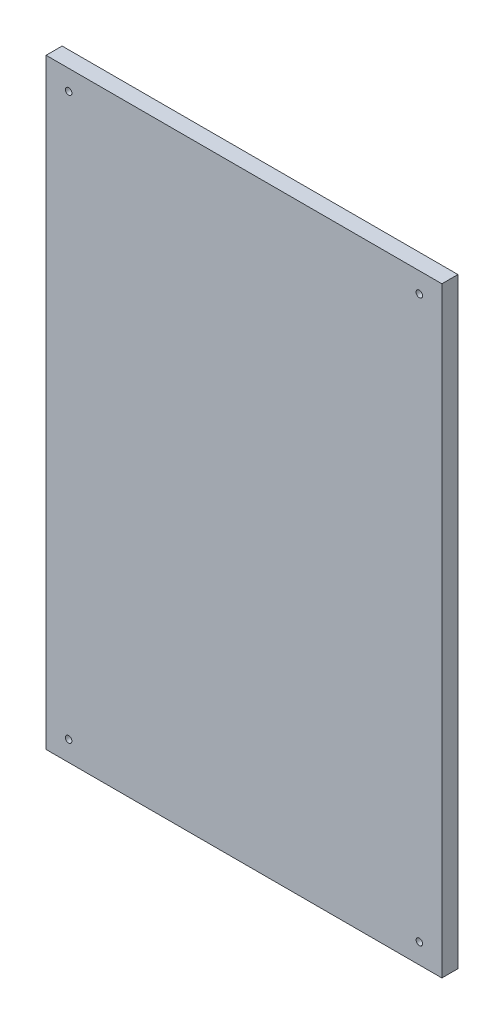
ISO-10303-21;
HEADER;
FILE_DESCRIPTION(('STEP AP214'),'2;1');
FILE_NAME('part.step','',(''),(''),'','','');
FILE_SCHEMA(('AUTOMOTIVE_DESIGN { 1 0 10303 214 1 1 1 1 }'));
ENDSEC;
DATA;
#1=APPLICATION_CONTEXT('core data for automotive mechanical design processes');
#2=APPLICATION_PROTOCOL_DEFINITION('international standard','automotive_design',2000,#1);
#3=PRODUCT_CONTEXT('',#1,'mechanical');
#4=PRODUCT('Part','Part','',(#3));
#5=PRODUCT_RELATED_PRODUCT_CATEGORY('part','',(#4));
#6=PRODUCT_DEFINITION_FORMATION('','',#4);
#7=PRODUCT_DEFINITION_CONTEXT('part definition',#1,'design');
#8=PRODUCT_DEFINITION('design','',#6,#7);
#9=PRODUCT_DEFINITION_SHAPE('','',#8);
#10=(LENGTH_UNIT() NAMED_UNIT(*) SI_UNIT(.MILLI.,.METRE.));
#11=(NAMED_UNIT(*) PLANE_ANGLE_UNIT() SI_UNIT($,.RADIAN.));
#12=(NAMED_UNIT(*) SI_UNIT($,.STERADIAN.) SOLID_ANGLE_UNIT());
#13=UNCERTAINTY_MEASURE_WITH_UNIT(LENGTH_MEASURE(1.E-05),#10,'distance_accuracy_value','');
#14=(GEOMETRIC_REPRESENTATION_CONTEXT(3) GLOBAL_UNCERTAINTY_ASSIGNED_CONTEXT((#13)) GLOBAL_UNIT_ASSIGNED_CONTEXT((#10,
#11,#12)) REPRESENTATION_CONTEXT('',''));
#15=CARTESIAN_POINT('',(0.,0.,0.));
#16=DIRECTION('',(0.,0.,1.));
#17=DIRECTION('',(1.,0.,0.));
#18=AXIS2_PLACEMENT_3D('',#15,#16,#17);
#19=CARTESIAN_POINT('',(0.,0.,16.));
#20=DIRECTION('',(1.,0.,0.));
#21=DIRECTION('',(0.,0.,-1.));
#22=AXIS2_PLACEMENT_3D('',#19,#20,#21);
#23=PLANE('',#22);
#24=DIRECTION('',(0.,-1.,0.));
#25=VECTOR('',#24,1.);
#26=CARTESIAN_POINT('',(0.,0.,0.));
#27=LINE('',#26,#25);
#28=CARTESIAN_POINT('',(0.,600.,0.));
#29=VERTEX_POINT('',#28);
#30=CARTESIAN_POINT('',(0.,0.,0.));
#31=VERTEX_POINT('',#30);
#32=EDGE_CURVE('E96',#29,#31,#27,.T.);
#33=ORIENTED_EDGE('',*,*,#32,.T.);
#34=DIRECTION('',(0.,0.,-1.));
#35=VECTOR('',#34,1.);
#36=CARTESIAN_POINT('',(0.,0.,16.));
#37=LINE('',#36,#35);
#38=CARTESIAN_POINT('',(0.,0.,16.));
#39=VERTEX_POINT('',#38);
#40=EDGE_CURVE('E11',#39,#31,#37,.T.);
#41=ORIENTED_EDGE('',*,*,#40,.F.);
#42=DIRECTION('',(0.,-1.,0.));
#43=VECTOR('',#42,1.);
#44=CARTESIAN_POINT('',(0.,0.,16.));
#45=LINE('',#44,#43);
#46=CARTESIAN_POINT('',(0.,600.,16.));
#47=VERTEX_POINT('',#46);
#48=EDGE_CURVE('E84',#47,#39,#45,.T.);
#49=ORIENTED_EDGE('',*,*,#48,.F.);
#50=DIRECTION('',(0.,0.,-1.));
#51=VECTOR('',#50,1.);
#52=CARTESIAN_POINT('',(0.,600.,16.));
#53=LINE('',#52,#51);
#54=EDGE_CURVE('E92',#47,#29,#53,.T.);
#55=ORIENTED_EDGE('',*,*,#54,.T.);
#56=EDGE_LOOP('',(#33,#41,#49,#55));
#57=FACE_BOUND('',#56,.T.);
#58=ADVANCED_FACE('F33',(#57),#23,.F.);
#59=CARTESIAN_POINT('',(0.,0.,16.));
#60=DIRECTION('',(0.,1.,0.));
#61=DIRECTION('',(0.,0.,1.));
#62=AXIS2_PLACEMENT_3D('',#59,#60,#61);
#63=PLANE('',#62);
#64=DIRECTION('',(1.,0.,0.));
#65=VECTOR('',#64,1.);
#66=CARTESIAN_POINT('',(0.,0.,0.));
#67=LINE('',#66,#65);
#68=CARTESIAN_POINT('',(395.,0.,0.));
#69=VERTEX_POINT('',#68);
#70=EDGE_CURVE('E88',#31,#69,#67,.T.);
#71=ORIENTED_EDGE('',*,*,#70,.T.);
#72=DIRECTION('',(0.,0.,-1.));
#73=VECTOR('',#72,1.);
#74=CARTESIAN_POINT('',(395.,0.,16.));
#75=LINE('',#74,#73);
#76=CARTESIAN_POINT('',(395.,0.,16.));
#77=VERTEX_POINT('',#76);
#78=EDGE_CURVE('E41',#77,#69,#75,.T.);
#79=ORIENTED_EDGE('',*,*,#78,.F.);
#80=DIRECTION('',(1.,0.,0.));
#81=VECTOR('',#80,1.);
#82=CARTESIAN_POINT('',(0.,0.,16.));
#83=LINE('',#82,#81);
#84=EDGE_CURVE('E79',#39,#77,#83,.T.);
#85=ORIENTED_EDGE('',*,*,#84,.F.);
#86=ORIENTED_EDGE('',*,*,#40,.T.);
#87=EDGE_LOOP('',(#71,#79,#85,#86));
#88=FACE_BOUND('',#87,.T.);
#89=ADVANCED_FACE('F87',(#88),#63,.F.);
#90=CARTESIAN_POINT('',(395.,0.,16.));
#91=DIRECTION('',(-1.,0.,0.));
#92=DIRECTION('',(0.,0.,1.));
#93=AXIS2_PLACEMENT_3D('',#90,#91,#92);
#94=PLANE('',#93);
#95=DIRECTION('',(0.,1.,0.));
#96=VECTOR('',#95,1.);
#97=CARTESIAN_POINT('',(395.,0.,0.));
#98=LINE('',#97,#96);
#99=CARTESIAN_POINT('',(395.,600.,0.));
#100=VERTEX_POINT('',#99);
#101=EDGE_CURVE('E66',#69,#100,#98,.T.);
#102=ORIENTED_EDGE('',*,*,#101,.T.);
#103=DIRECTION('',(0.,0.,-1.));
#104=VECTOR('',#103,1.);
#105=CARTESIAN_POINT('',(395.,600.,16.));
#106=LINE('',#105,#104);
#107=CARTESIAN_POINT('',(395.,600.,16.));
#108=VERTEX_POINT('',#107);
#109=EDGE_CURVE('E89',#108,#100,#106,.T.);
#110=ORIENTED_EDGE('',*,*,#109,.F.);
#111=DIRECTION('',(0.,1.,0.));
#112=VECTOR('',#111,1.);
#113=CARTESIAN_POINT('',(395.,0.,16.));
#114=LINE('',#113,#112);
#115=EDGE_CURVE('E82',#77,#108,#114,.T.);
#116=ORIENTED_EDGE('',*,*,#115,.F.);
#117=ORIENTED_EDGE('',*,*,#78,.T.);
#118=EDGE_LOOP('',(#102,#110,#116,#117));
#119=FACE_BOUND('',#118,.T.);
#120=ADVANCED_FACE('F90',(#119),#94,.F.);
#121=CARTESIAN_POINT('',(0.,600.,16.));
#122=DIRECTION('',(0.,-1.,0.));
#123=DIRECTION('',(0.,0.,-1.));
#124=AXIS2_PLACEMENT_3D('',#121,#122,#123);
#125=PLANE('',#124);
#126=DIRECTION('',(-1.,0.,0.));
#127=VECTOR('',#126,1.);
#128=CARTESIAN_POINT('',(0.,600.,0.));
#129=LINE('',#128,#127);
#130=EDGE_CURVE('E72',#100,#29,#129,.T.);
#131=ORIENTED_EDGE('',*,*,#130,.T.);
#132=ORIENTED_EDGE('',*,*,#54,.F.);
#133=DIRECTION('',(-1.,0.,0.));
#134=VECTOR('',#133,1.);
#135=CARTESIAN_POINT('',(0.,600.,16.));
#136=LINE('',#135,#134);
#137=EDGE_CURVE('E49',#108,#47,#136,.T.);
#138=ORIENTED_EDGE('',*,*,#137,.F.);
#139=ORIENTED_EDGE('',*,*,#109,.T.);
#140=EDGE_LOOP('',(#131,#132,#138,#139));
#141=FACE_BOUND('',#140,.T.);
#142=ADVANCED_FACE('F104',(#141),#125,.F.);
#143=CARTESIAN_POINT('',(0.,0.,16.));
#144=DIRECTION('',(0.,0.,-1.));
#145=DIRECTION('',(-1.,0.,0.));
#146=AXIS2_PLACEMENT_3D('',#143,#144,#145);
#147=PLANE('',#146);
#148=CARTESIAN_POINT('',(372.5,580.,16.));
#149=DIRECTION('',(0.,0.,1.));
#150=DIRECTION('',(1.,0.,0.));
#151=AXIS2_PLACEMENT_3D('',#148,#149,#150);
#152=CIRCLE('',#151,3.24999999999989);
#153=CARTESIAN_POINT('',(375.75,580.,16.));
#154=VERTEX_POINT('',#153);
#155=EDGE_CURVE('E128',#154,#154,#152,.T.);
#156=ORIENTED_EDGE('',*,*,#155,.F.);
#157=EDGE_LOOP('',(#156));
#158=FACE_BOUND('',#157,.T.);
#159=CARTESIAN_POINT('',(22.5000000000002,20.,16.));
#160=DIRECTION('',(0.,0.,1.));
#161=DIRECTION('',(-1.,0.,0.));
#162=AXIS2_PLACEMENT_3D('',#159,#160,#161);
#163=CIRCLE('',#162,3.24999999999995);
#164=CARTESIAN_POINT('',(19.2500000000003,20.,16.));
#165=VERTEX_POINT('',#164);
#166=EDGE_CURVE('E122',#165,#165,#163,.T.);
#167=ORIENTED_EDGE('',*,*,#166,.F.);
#168=EDGE_LOOP('',(#167));
#169=FACE_BOUND('',#168,.T.);
#170=CARTESIAN_POINT('',(372.5,20.,16.));
#171=DIRECTION('',(0.,0.,1.));
#172=DIRECTION('',(-1.,0.,0.));
#173=AXIS2_PLACEMENT_3D('',#170,#171,#172);
#174=CIRCLE('',#173,3.24999999999989);
#175=CARTESIAN_POINT('',(369.25,20.,16.));
#176=VERTEX_POINT('',#175);
#177=EDGE_CURVE('E116',#176,#176,#174,.T.);
#178=ORIENTED_EDGE('',*,*,#177,.F.);
#179=EDGE_LOOP('',(#178));
#180=FACE_BOUND('',#179,.T.);
#181=CARTESIAN_POINT('',(22.5000000000002,580.,16.));
#182=DIRECTION('',(0.,0.,1.));
#183=DIRECTION('',(1.,0.,0.));
#184=AXIS2_PLACEMENT_3D('',#181,#182,#183);
#185=CIRCLE('',#184,3.24999999999995);
#186=CARTESIAN_POINT('',(25.7500000000002,580.,16.));
#187=VERTEX_POINT('',#186);
#188=EDGE_CURVE('E110',#187,#187,#185,.T.);
#189=ORIENTED_EDGE('',*,*,#188,.F.);
#190=EDGE_LOOP('',(#189));
#191=FACE_BOUND('',#190,.T.);
#192=ORIENTED_EDGE('',*,*,#48,.T.);
#193=ORIENTED_EDGE('',*,*,#84,.T.);
#194=ORIENTED_EDGE('',*,*,#115,.T.);
#195=ORIENTED_EDGE('',*,*,#137,.T.);
#196=EDGE_LOOP('',(#192,#193,#194,#195));
#197=FACE_BOUND('',#196,.T.);
#198=ADVANCED_FACE('F80',(#158,#169,#180,#191,#197),#147,.F.);
#199=CARTESIAN_POINT('',(0.,0.,0.));
#200=DIRECTION('',(0.,0.,-1.));
#201=DIRECTION('',(-1.,0.,0.));
#202=AXIS2_PLACEMENT_3D('',#199,#200,#201);
#203=PLANE('',#202);
#204=CARTESIAN_POINT('',(372.5,580.,0.));
#205=DIRECTION('',(0.,0.,1.));
#206=DIRECTION('',(1.,0.,0.));
#207=AXIS2_PLACEMENT_3D('',#204,#205,#206);
#208=CIRCLE('',#207,3.24999999999989);
#209=CARTESIAN_POINT('',(375.75,580.,0.));
#210=VERTEX_POINT('',#209);
#211=EDGE_CURVE('E113',#210,#210,#208,.T.);
#212=ORIENTED_EDGE('',*,*,#211,.T.);
#213=EDGE_LOOP('',(#212));
#214=FACE_BOUND('',#213,.T.);
#215=CARTESIAN_POINT('',(22.5000000000002,20.,0.));
#216=DIRECTION('',(0.,0.,1.));
#217=DIRECTION('',(-1.,0.,0.));
#218=AXIS2_PLACEMENT_3D('',#215,#216,#217);
#219=CIRCLE('',#218,3.24999999999995);
#220=CARTESIAN_POINT('',(19.2500000000003,20.,0.));
#221=VERTEX_POINT('',#220);
#222=EDGE_CURVE('E125',#221,#221,#219,.T.);
#223=ORIENTED_EDGE('',*,*,#222,.T.);
#224=EDGE_LOOP('',(#223));
#225=FACE_BOUND('',#224,.T.);
#226=CARTESIAN_POINT('',(372.5,20.,0.));
#227=DIRECTION('',(0.,0.,1.));
#228=DIRECTION('',(-1.,0.,0.));
#229=AXIS2_PLACEMENT_3D('',#226,#227,#228);
#230=CIRCLE('',#229,3.24999999999989);
#231=CARTESIAN_POINT('',(369.25,20.,0.));
#232=VERTEX_POINT('',#231);
#233=EDGE_CURVE('E119',#232,#232,#230,.T.);
#234=ORIENTED_EDGE('',*,*,#233,.T.);
#235=EDGE_LOOP('',(#234));
#236=FACE_BOUND('',#235,.T.);
#237=CARTESIAN_POINT('',(22.5000000000002,580.,0.));
#238=DIRECTION('',(0.,0.,1.));
#239=DIRECTION('',(1.,0.,0.));
#240=AXIS2_PLACEMENT_3D('',#237,#238,#239);
#241=CIRCLE('',#240,3.24999999999995);
#242=CARTESIAN_POINT('',(25.7500000000002,580.,0.));
#243=VERTEX_POINT('',#242);
#244=EDGE_CURVE('E99',#243,#243,#241,.T.);
#245=ORIENTED_EDGE('',*,*,#244,.T.);
#246=EDGE_LOOP('',(#245));
#247=FACE_BOUND('',#246,.T.);
#248=ORIENTED_EDGE('',*,*,#32,.F.);
#249=ORIENTED_EDGE('',*,*,#130,.F.);
#250=ORIENTED_EDGE('',*,*,#101,.F.);
#251=ORIENTED_EDGE('',*,*,#70,.F.);
#252=EDGE_LOOP('',(#248,#249,#250,#251));
#253=FACE_BOUND('',#252,.T.);
#254=ADVANCED_FACE('F107',(#214,#225,#236,#247,#253),#203,.T.);
#255=CARTESIAN_POINT('',(22.5000000000002,580.,0.));
#256=DIRECTION('',(0.,0.,1.));
#257=DIRECTION('',(1.,0.,0.));
#258=AXIS2_PLACEMENT_3D('',#255,#256,#257);
#259=CYLINDRICAL_SURFACE('',#258,3.24999999999995);
#260=ORIENTED_EDGE('',*,*,#244,.F.);
#261=EDGE_LOOP('',(#260));
#262=FACE_BOUND('',#261,.T.);
#263=ORIENTED_EDGE('',*,*,#188,.T.);
#264=EDGE_LOOP('',(#263));
#265=FACE_BOUND('',#264,.T.);
#266=ADVANCED_FACE('F152',(#262,#265),#259,.F.);
#267=CARTESIAN_POINT('',(372.5,20.,0.));
#268=DIRECTION('',(0.,0.,1.));
#269=DIRECTION('',(1.,0.,0.));
#270=AXIS2_PLACEMENT_3D('',#267,#268,#269);
#271=CYLINDRICAL_SURFACE('',#270,3.24999999999989);
#272=ORIENTED_EDGE('',*,*,#233,.F.);
#273=EDGE_LOOP('',(#272));
#274=FACE_BOUND('',#273,.T.);
#275=ORIENTED_EDGE('',*,*,#177,.T.);
#276=EDGE_LOOP('',(#275));
#277=FACE_BOUND('',#276,.T.);
#278=ADVANCED_FACE('F154',(#274,#277),#271,.F.);
#279=CARTESIAN_POINT('',(22.5000000000002,20.,0.));
#280=DIRECTION('',(0.,0.,1.));
#281=DIRECTION('',(1.,0.,0.));
#282=AXIS2_PLACEMENT_3D('',#279,#280,#281);
#283=CYLINDRICAL_SURFACE('',#282,3.24999999999995);
#284=ORIENTED_EDGE('',*,*,#222,.F.);
#285=EDGE_LOOP('',(#284));
#286=FACE_BOUND('',#285,.T.);
#287=ORIENTED_EDGE('',*,*,#166,.T.);
#288=EDGE_LOOP('',(#287));
#289=FACE_BOUND('',#288,.T.);
#290=ADVANCED_FACE('F139',(#286,#289),#283,.F.);
#291=CARTESIAN_POINT('',(372.5,580.,0.));
#292=DIRECTION('',(0.,0.,1.));
#293=DIRECTION('',(1.,0.,0.));
#294=AXIS2_PLACEMENT_3D('',#291,#292,#293);
#295=CYLINDRICAL_SURFACE('',#294,3.24999999999989);
#296=ORIENTED_EDGE('',*,*,#211,.F.);
#297=EDGE_LOOP('',(#296));
#298=FACE_BOUND('',#297,.T.);
#299=ORIENTED_EDGE('',*,*,#155,.T.);
#300=EDGE_LOOP('',(#299));
#301=FACE_BOUND('',#300,.T.);
#302=ADVANCED_FACE('F136',(#298,#301),#295,.F.);
#303=CLOSED_SHELL('',(#58,#89,#120,#142,#198,#254,#266,#278,#290,#302));
#304=MANIFOLD_SOLID_BREP('B2',#303);
#305=ADVANCED_BREP_SHAPE_REPRESENTATION('',(#18,#304),#14);
#306=SHAPE_DEFINITION_REPRESENTATION(#9,#305);
ENDSEC;
END-ISO-10303-21;
